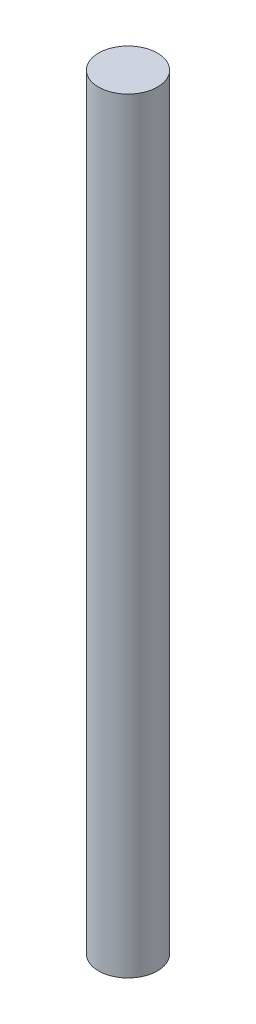
ISO-10303-21;
HEADER;
FILE_DESCRIPTION(('STEP AP214'),'2;1');
FILE_NAME('part.step','',(''),(''),'','','');
FILE_SCHEMA(('AUTOMOTIVE_DESIGN { 1 0 10303 214 1 1 1 1 }'));
ENDSEC;
DATA;
#1=APPLICATION_CONTEXT('core data for automotive mechanical design processes');
#2=APPLICATION_PROTOCOL_DEFINITION('international standard','automotive_design',2000,#1);
#3=PRODUCT_CONTEXT('',#1,'mechanical');
#4=PRODUCT('Part','Part','',(#3));
#5=PRODUCT_RELATED_PRODUCT_CATEGORY('part','',(#4));
#6=PRODUCT_DEFINITION_FORMATION('','',#4);
#7=PRODUCT_DEFINITION_CONTEXT('part definition',#1,'design');
#8=PRODUCT_DEFINITION('design','',#6,#7);
#9=PRODUCT_DEFINITION_SHAPE('','',#8);
#10=(LENGTH_UNIT() NAMED_UNIT(*) SI_UNIT(.MILLI.,.METRE.));
#11=(NAMED_UNIT(*) PLANE_ANGLE_UNIT() SI_UNIT($,.RADIAN.));
#12=(NAMED_UNIT(*) SI_UNIT($,.STERADIAN.) SOLID_ANGLE_UNIT());
#13=UNCERTAINTY_MEASURE_WITH_UNIT(LENGTH_MEASURE(1.E-05),#10,'distance_accuracy_value','');
#14=(GEOMETRIC_REPRESENTATION_CONTEXT(3) GLOBAL_UNCERTAINTY_ASSIGNED_CONTEXT((#13)) GLOBAL_UNIT_ASSIGNED_CONTEXT((#10,
#11,#12)) REPRESENTATION_CONTEXT('',''));
#15=CARTESIAN_POINT('',(0.,0.,0.));
#16=DIRECTION('',(0.,0.,1.));
#17=DIRECTION('',(1.,0.,0.));
#18=AXIS2_PLACEMENT_3D('',#15,#16,#17);
#19=CARTESIAN_POINT('',(0.,165.,0.));
#20=DIRECTION('',(0.,-1.,0.));
#21=DIRECTION('',(0.,0.,-1.));
#22=AXIS2_PLACEMENT_3D('',#19,#20,#21);
#23=CYLINDRICAL_SURFACE('',#22,6.35);
#24=CARTESIAN_POINT('',(0.,165.,0.));
#25=DIRECTION('',(0.,1.,0.));
#26=DIRECTION('',(0.,0.,1.));
#27=AXIS2_PLACEMENT_3D('',#24,#25,#26);
#28=CIRCLE('',#27,6.35);
#29=CARTESIAN_POINT('',(0.,165.,6.35));
#30=VERTEX_POINT('',#29);
#31=EDGE_CURVE('E10',#30,#30,#28,.T.);
#32=ORIENTED_EDGE('',*,*,#31,.F.);
#33=EDGE_LOOP('',(#32));
#34=FACE_BOUND('',#33,.T.);
#35=CARTESIAN_POINT('',(0.,0.,0.));
#36=DIRECTION('',(0.,1.,0.));
#37=DIRECTION('',(0.,0.,1.));
#38=AXIS2_PLACEMENT_3D('',#35,#36,#37);
#39=CIRCLE('',#38,6.35);
#40=CARTESIAN_POINT('',(0.,0.,6.35));
#41=VERTEX_POINT('',#40);
#42=EDGE_CURVE('E34',#41,#41,#39,.T.);
#43=ORIENTED_EDGE('',*,*,#42,.T.);
#44=EDGE_LOOP('',(#43));
#45=FACE_BOUND('',#44,.T.);
#46=ADVANCED_FACE('F31',(#34,#45),#23,.T.);
#47=CARTESIAN_POINT('',(0.,165.,0.));
#48=DIRECTION('',(0.,1.,0.));
#49=DIRECTION('',(0.,0.,1.));
#50=AXIS2_PLACEMENT_3D('',#47,#48,#49);
#51=PLANE('',#50);
#52=ORIENTED_EDGE('',*,*,#31,.T.);
#53=EDGE_LOOP('',(#52));
#54=FACE_BOUND('',#53,.T.);
#55=ADVANCED_FACE('F46',(#54),#51,.T.);
#56=CARTESIAN_POINT('',(0.,0.,0.));
#57=DIRECTION('',(0.,1.,0.));
#58=DIRECTION('',(0.,0.,1.));
#59=AXIS2_PLACEMENT_3D('',#56,#57,#58);
#60=PLANE('',#59);
#61=ORIENTED_EDGE('',*,*,#42,.F.);
#62=EDGE_LOOP('',(#61));
#63=FACE_BOUND('',#62,.T.);
#64=ADVANCED_FACE('F44',(#63),#60,.F.);
#65=CLOSED_SHELL('',(#46,#55,#64));
#66=MANIFOLD_SOLID_BREP('B2',#65);
#67=ADVANCED_BREP_SHAPE_REPRESENTATION('',(#18,#66),#14);
#68=SHAPE_DEFINITION_REPRESENTATION(#9,#67);
ENDSEC;
END-ISO-10303-21;
